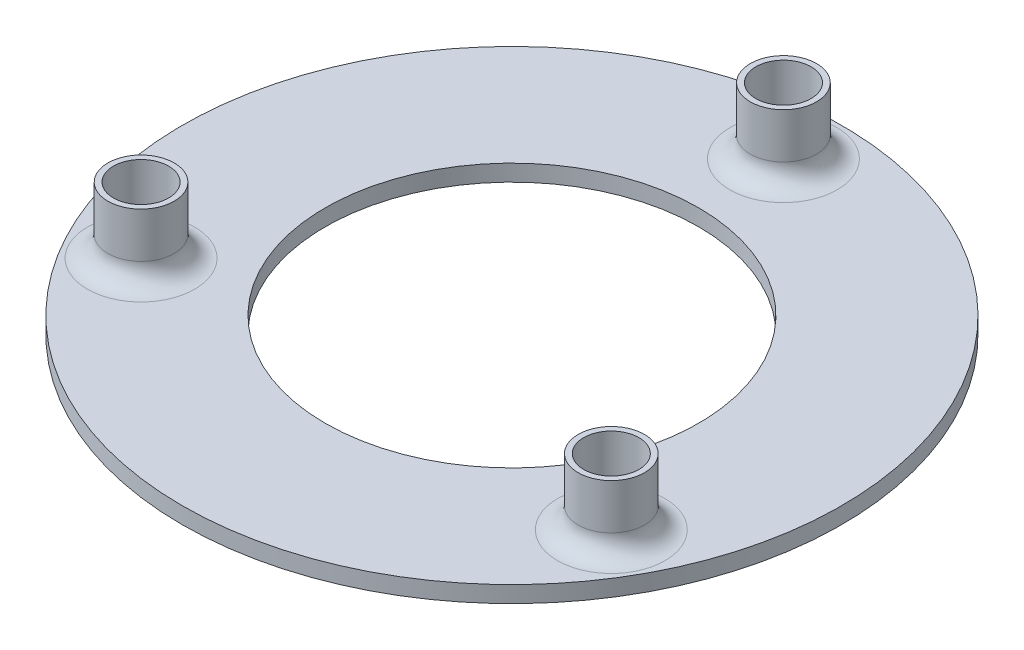
ISO-10303-21;
HEADER;
FILE_DESCRIPTION(('STEP AP214'),'2;1');
FILE_NAME('part.step','',(''),(''),'','','');
FILE_SCHEMA(('AUTOMOTIVE_DESIGN { 1 0 10303 214 1 1 1 1 }'));
ENDSEC;
DATA;
#1=APPLICATION_CONTEXT('core data for automotive mechanical design processes');
#2=APPLICATION_PROTOCOL_DEFINITION('international standard','automotive_design',2000,#1);
#3=PRODUCT_CONTEXT('',#1,'mechanical');
#4=PRODUCT('Part','Part','',(#3));
#5=PRODUCT_RELATED_PRODUCT_CATEGORY('part','',(#4));
#6=PRODUCT_DEFINITION_FORMATION('','',#4);
#7=PRODUCT_DEFINITION_CONTEXT('part definition',#1,'design');
#8=PRODUCT_DEFINITION('design','',#6,#7);
#9=PRODUCT_DEFINITION_SHAPE('','',#8);
#10=(LENGTH_UNIT() NAMED_UNIT(*) SI_UNIT(.MILLI.,.METRE.));
#11=(NAMED_UNIT(*) PLANE_ANGLE_UNIT() SI_UNIT($,.RADIAN.));
#12=(NAMED_UNIT(*) SI_UNIT($,.STERADIAN.) SOLID_ANGLE_UNIT());
#13=UNCERTAINTY_MEASURE_WITH_UNIT(LENGTH_MEASURE(1.E-05),#10,'distance_accuracy_value','');
#14=(GEOMETRIC_REPRESENTATION_CONTEXT(3) GLOBAL_UNCERTAINTY_ASSIGNED_CONTEXT((#13)) GLOBAL_UNIT_ASSIGNED_CONTEXT((#10,
#11,#12)) REPRESENTATION_CONTEXT('',''));
#15=CARTESIAN_POINT('',(0.,0.,0.));
#16=DIRECTION('',(0.,0.,1.));
#17=DIRECTION('',(1.,0.,0.));
#18=AXIS2_PLACEMENT_3D('',#15,#16,#17);
#19=CARTESIAN_POINT('',(0.,4.,0.));
#20=DIRECTION('',(0.,1.,0.));
#21=DIRECTION('',(0.,0.,1.));
#22=AXIS2_PLACEMENT_3D('',#19,#20,#21);
#23=PLANE('',#22);
#24=CARTESIAN_POINT('',(57.0778085372855,4.,32.954885136184));
#25=DIRECTION('',(0.,1.,0.));
#26=DIRECTION('',(0.,0.,1.));
#27=AXIS2_PLACEMENT_3D('',#24,#25,#26);
#28=CIRCLE('',#27,13.0460618645463);
#29=CARTESIAN_POINT('',(57.0778085372855,4.,46.0009470007304));
#30=VERTEX_POINT('',#29);
#31=EDGE_CURVE('E67',#30,#30,#28,.F.);
#32=ORIENTED_EDGE('',*,*,#31,.T.);
#33=EDGE_LOOP('',(#32));
#34=FACE_BOUND('',#33,.T.);
#35=CARTESIAN_POINT('',(0.0012626430097959,4.,-65.9045922732219));
#36=DIRECTION('',(0.,1.,0.));
#37=DIRECTION('',(0.,0.,1.));
#38=AXIS2_PLACEMENT_3D('',#35,#36,#37);
#39=CIRCLE('',#38,13.0460618645463);
#40=CARTESIAN_POINT('',(0.0012626430097959,4.,-52.8585304086756));
#41=VERTEX_POINT('',#40);
#42=EDGE_CURVE('E73',#41,#41,#39,.F.);
#43=ORIENTED_EDGE('',*,*,#42,.T.);
#44=EDGE_LOOP('',(#43));
#45=FACE_BOUND('',#44,.T.);
#46=CARTESIAN_POINT('',(-57.0752832512517,4.,32.9548851361923));
#47=DIRECTION('',(0.,1.,0.));
#48=DIRECTION('',(0.,0.,1.));
#49=AXIS2_PLACEMENT_3D('',#46,#47,#48);
#50=CIRCLE('',#49,13.0460618645463);
#51=CARTESIAN_POINT('',(-57.0752832512517,4.,46.0009470007387));
#52=VERTEX_POINT('',#51);
#53=EDGE_CURVE('E77',#52,#52,#50,.F.);
#54=ORIENTED_EDGE('',*,*,#53,.T.);
#55=EDGE_LOOP('',(#54));
#56=FACE_BOUND('',#55,.T.);
#57=CARTESIAN_POINT('',(0.,4.,0.));
#58=DIRECTION('',(0.,1.,0.));
#59=DIRECTION('',(0.,0.,1.));
#60=AXIS2_PLACEMENT_3D('',#57,#58,#59);
#61=CIRCLE('',#60,80.);
#62=CARTESIAN_POINT('',(0.,4.,80.));
#63=VERTEX_POINT('',#62);
#64=EDGE_CURVE('E86',#63,#63,#61,.T.);
#65=ORIENTED_EDGE('',*,*,#64,.T.);
#66=EDGE_LOOP('',(#65));
#67=FACE_BOUND('',#66,.T.);
#68=CARTESIAN_POINT('',(0.,4.,0.));
#69=DIRECTION('',(0.,1.,0.));
#70=DIRECTION('',(0.,0.,1.));
#71=AXIS2_PLACEMENT_3D('',#68,#69,#70);
#72=CIRCLE('',#71,45.315839153059);
#73=CARTESIAN_POINT('',(0.,4.,45.315839153059));
#74=VERTEX_POINT('',#73);
#75=EDGE_CURVE('E87',#74,#74,#72,.T.);
#76=ORIENTED_EDGE('',*,*,#75,.F.);
#77=EDGE_LOOP('',(#76));
#78=FACE_BOUND('',#77,.T.);
#79=ADVANCED_FACE('F49',(#34,#45,#56,#67,#78),#23,.T.);
#80=CARTESIAN_POINT('',(0.,0.,0.));
#81=DIRECTION('',(0.,1.,0.));
#82=DIRECTION('',(0.,0.,1.));
#83=AXIS2_PLACEMENT_3D('',#80,#81,#82);
#84=PLANE('',#83);
#85=CARTESIAN_POINT('',(0.,0.,0.));
#86=DIRECTION('',(0.,1.,0.));
#87=DIRECTION('',(0.,0.,1.));
#88=AXIS2_PLACEMENT_3D('',#85,#86,#87);
#89=CIRCLE('',#88,80.);
#90=CARTESIAN_POINT('',(0.,0.,80.));
#91=VERTEX_POINT('',#90);
#92=EDGE_CURVE('E82',#91,#91,#89,.T.);
#93=ORIENTED_EDGE('',*,*,#92,.F.);
#94=EDGE_LOOP('',(#93));
#95=FACE_BOUND('',#94,.T.);
#96=CARTESIAN_POINT('',(0.,0.,0.));
#97=DIRECTION('',(0.,1.,0.));
#98=DIRECTION('',(0.,0.,1.));
#99=AXIS2_PLACEMENT_3D('',#96,#97,#98);
#100=CIRCLE('',#99,45.315839153059);
#101=CARTESIAN_POINT('',(0.,0.,45.315839153059));
#102=VERTEX_POINT('',#101);
#103=EDGE_CURVE('E92',#102,#102,#100,.T.);
#104=ORIENTED_EDGE('',*,*,#103,.T.);
#105=EDGE_LOOP('',(#104));
#106=FACE_BOUND('',#105,.T.);
#107=ADVANCED_FACE('F154',(#95,#106),#84,.F.);
#108=CARTESIAN_POINT('',(0.,4.,0.));
#109=DIRECTION('',(0.,-1.,0.));
#110=DIRECTION('',(0.,0.,-1.));
#111=AXIS2_PLACEMENT_3D('',#108,#109,#110);
#112=CYLINDRICAL_SURFACE('',#111,80.);
#113=ORIENTED_EDGE('',*,*,#64,.F.);
#114=EDGE_LOOP('',(#113));
#115=FACE_BOUND('',#114,.T.);
#116=ORIENTED_EDGE('',*,*,#92,.T.);
#117=EDGE_LOOP('',(#116));
#118=FACE_BOUND('',#117,.T.);
#119=ADVANCED_FACE('F161',(#115,#118),#112,.T.);
#120=CARTESIAN_POINT('',(0.,4.,0.));
#121=DIRECTION('',(0.,-1.,0.));
#122=DIRECTION('',(0.,0.,-1.));
#123=AXIS2_PLACEMENT_3D('',#120,#121,#122);
#124=CYLINDRICAL_SURFACE('',#123,45.315839153059);
#125=ORIENTED_EDGE('',*,*,#75,.T.);
#126=EDGE_LOOP('',(#125));
#127=FACE_BOUND('',#126,.T.);
#128=ORIENTED_EDGE('',*,*,#103,.F.);
#129=EDGE_LOOP('',(#128));
#130=FACE_BOUND('',#129,.T.);
#131=ADVANCED_FACE('F207',(#127,#130),#124,.F.);
#132=CARTESIAN_POINT('',(-57.0752832512517,20.,32.9548851361923));
#133=DIRECTION('',(0.,-1.,0.));
#134=DIRECTION('',(0.,0.,-1.));
#135=AXIS2_PLACEMENT_3D('',#132,#133,#134);
#136=CYLINDRICAL_SURFACE('',#135,6.70505155378861);
#137=CARTESIAN_POINT('',(-57.0752832512517,4.,32.9548851361923));
#138=DIRECTION('',(0.,1.,0.));
#139=DIRECTION('',(0.,0.,1.));
#140=AXIS2_PLACEMENT_3D('',#137,#138,#139);
#141=CIRCLE('',#140,6.70505155378861);
#142=CARTESIAN_POINT('',(-57.0752832512517,4.,39.6599366899809));
#143=VERTEX_POINT('',#142);
#144=EDGE_CURVE('E91',#143,#143,#141,.F.);
#145=ORIENTED_EDGE('',*,*,#144,.T.);
#146=EDGE_LOOP('',(#145));
#147=FACE_BOUND('',#146,.T.);
#148=CARTESIAN_POINT('',(-57.0752832512517,20.,32.9548851361923));
#149=DIRECTION('',(0.,1.,0.));
#150=DIRECTION('',(0.,0.,1.));
#151=AXIS2_PLACEMENT_3D('',#148,#149,#150);
#152=CIRCLE('',#151,6.70505155378861);
#153=CARTESIAN_POINT('',(-57.0752832512517,20.,39.6599366899809));
#154=VERTEX_POINT('',#153);
#155=EDGE_CURVE('E107',#154,#154,#152,.T.);
#156=ORIENTED_EDGE('',*,*,#155,.T.);
#157=EDGE_LOOP('',(#156));
#158=FACE_BOUND('',#157,.T.);
#159=ADVANCED_FACE('F205',(#147,#158),#136,.F.);
#160=CARTESIAN_POINT('',(-57.0752832512517,20.,32.9548851361923));
#161=DIRECTION('',(0.,-1.,0.));
#162=DIRECTION('',(0.,0.,-1.));
#163=AXIS2_PLACEMENT_3D('',#160,#161,#162);
#164=CYLINDRICAL_SURFACE('',#163,8.04606186454634);
#165=CARTESIAN_POINT('',(-57.0752832512517,9.,32.9548851361923));
#166=DIRECTION('',(0.,1.,0.));
#167=DIRECTION('',(0.,0.,1.));
#168=AXIS2_PLACEMENT_3D('',#165,#166,#167);
#169=CIRCLE('',#168,8.04606186454634);
#170=CARTESIAN_POINT('',(-57.0752832512517,9.,41.0009470007387));
#171=VERTEX_POINT('',#170);
#172=EDGE_CURVE('E11',#171,#171,#169,.T.);
#173=ORIENTED_EDGE('',*,*,#172,.T.);
#174=EDGE_LOOP('',(#173));
#175=FACE_BOUND('',#174,.T.);
#176=CARTESIAN_POINT('',(-57.0752832512517,20.,32.9548851361923));
#177=DIRECTION('',(0.,1.,0.));
#178=DIRECTION('',(0.,0.,1.));
#179=AXIS2_PLACEMENT_3D('',#176,#177,#178);
#180=CIRCLE('',#179,8.04606186454634);
#181=CARTESIAN_POINT('',(-57.0752832512517,20.,41.0009470007387));
#182=VERTEX_POINT('',#181);
#183=EDGE_CURVE('E96',#182,#182,#180,.T.);
#184=ORIENTED_EDGE('',*,*,#183,.F.);
#185=EDGE_LOOP('',(#184));
#186=FACE_BOUND('',#185,.T.);
#187=ADVANCED_FACE('F180',(#175,#186),#164,.T.);
#188=CARTESIAN_POINT('',(0.,20.,0.));
#189=DIRECTION('',(0.,1.,0.));
#190=DIRECTION('',(0.,0.,1.));
#191=AXIS2_PLACEMENT_3D('',#188,#189,#190);
#192=PLANE('',#191);
#193=ORIENTED_EDGE('',*,*,#155,.F.);
#194=EDGE_LOOP('',(#193));
#195=FACE_BOUND('',#194,.T.);
#196=ORIENTED_EDGE('',*,*,#183,.T.);
#197=EDGE_LOOP('',(#196));
#198=FACE_BOUND('',#197,.T.);
#199=ADVANCED_FACE('F171',(#195,#198),#192,.T.);
#200=ORIENTED_EDGE('',*,*,#144,.F.);
#201=EDGE_LOOP('',(#200));
#202=FACE_BOUND('',#201,.T.);
#203=ADVANCED_FACE('F157',(#202),#23,.T.);
#204=CARTESIAN_POINT('',(0.0012626430097959,20.,-65.9045922732219));
#205=DIRECTION('',(0.,-1.,0.));
#206=DIRECTION('',(0.,0.,-1.));
#207=AXIS2_PLACEMENT_3D('',#204,#205,#206);
#208=CYLINDRICAL_SURFACE('',#207,6.7050515537886);
#209=CARTESIAN_POINT('',(0.0012626430097959,4.,-65.9045922732219));
#210=DIRECTION('',(0.,1.,0.));
#211=DIRECTION('',(0.,0.,1.));
#212=AXIS2_PLACEMENT_3D('',#209,#210,#211);
#213=CIRCLE('',#212,6.7050515537886);
#214=CARTESIAN_POINT('',(0.0012626430097959,4.,-59.1995407194333));
#215=VERTEX_POINT('',#214);
#216=EDGE_CURVE('E103',#215,#215,#213,.F.);
#217=ORIENTED_EDGE('',*,*,#216,.T.);
#218=EDGE_LOOP('',(#217));
#219=FACE_BOUND('',#218,.T.);
#220=CARTESIAN_POINT('',(0.0012626430097959,20.,-65.9045922732219));
#221=DIRECTION('',(0.,1.,0.));
#222=DIRECTION('',(0.,0.,1.));
#223=AXIS2_PLACEMENT_3D('',#220,#221,#222);
#224=CIRCLE('',#223,6.7050515537886);
#225=CARTESIAN_POINT('',(0.0012626430097959,20.,-59.1995407194333));
#226=VERTEX_POINT('',#225);
#227=EDGE_CURVE('E118',#226,#226,#224,.T.);
#228=ORIENTED_EDGE('',*,*,#227,.T.);
#229=EDGE_LOOP('',(#228));
#230=FACE_BOUND('',#229,.T.);
#231=ADVANCED_FACE('F170',(#219,#230),#208,.F.);
#232=CARTESIAN_POINT('',(0.0012626430097959,20.,-65.9045922732219));
#233=DIRECTION('',(0.,-1.,0.));
#234=DIRECTION('',(0.,0.,-1.));
#235=AXIS2_PLACEMENT_3D('',#232,#233,#234);
#236=CYLINDRICAL_SURFACE('',#235,8.04606186454632);
#237=CARTESIAN_POINT('',(0.0012626430097959,9.,-65.9045922732219));
#238=DIRECTION('',(0.,1.,0.));
#239=DIRECTION('',(0.,0.,1.));
#240=AXIS2_PLACEMENT_3D('',#237,#238,#239);
#241=CIRCLE('',#240,8.04606186454632);
#242=CARTESIAN_POINT('',(0.0012626430097959,9.,-57.8585304086756));
#243=VERTEX_POINT('',#242);
#244=EDGE_CURVE('E57',#243,#243,#241,.T.);
#245=ORIENTED_EDGE('',*,*,#244,.T.);
#246=EDGE_LOOP('',(#245));
#247=FACE_BOUND('',#246,.T.);
#248=CARTESIAN_POINT('',(0.0012626430097959,20.,-65.9045922732219));
#249=DIRECTION('',(0.,1.,0.));
#250=DIRECTION('',(0.,0.,1.));
#251=AXIS2_PLACEMENT_3D('',#248,#249,#250);
#252=CIRCLE('',#251,8.04606186454632);
#253=CARTESIAN_POINT('',(0.0012626430097959,20.,-57.8585304086756));
#254=VERTEX_POINT('',#253);
#255=EDGE_CURVE('E111',#254,#254,#252,.T.);
#256=ORIENTED_EDGE('',*,*,#255,.F.);
#257=EDGE_LOOP('',(#256));
#258=FACE_BOUND('',#257,.T.);
#259=ADVANCED_FACE('F177',(#247,#258),#236,.T.);
#260=CARTESIAN_POINT('',(0.,20.,0.));
#261=DIRECTION('',(0.,1.,0.));
#262=DIRECTION('',(0.,0.,1.));
#263=AXIS2_PLACEMENT_3D('',#260,#261,#262);
#264=PLANE('',#263);
#265=ORIENTED_EDGE('',*,*,#227,.F.);
#266=EDGE_LOOP('',(#265));
#267=FACE_BOUND('',#266,.T.);
#268=ORIENTED_EDGE('',*,*,#255,.T.);
#269=EDGE_LOOP('',(#268));
#270=FACE_BOUND('',#269,.T.);
#271=ADVANCED_FACE('F185',(#267,#270),#264,.T.);
#272=ORIENTED_EDGE('',*,*,#216,.F.);
#273=EDGE_LOOP('',(#272));
#274=FACE_BOUND('',#273,.T.);
#275=ADVANCED_FACE('F150',(#274),#23,.T.);
#276=CARTESIAN_POINT('',(57.0778085372855,20.,32.954885136184));
#277=DIRECTION('',(0.,-1.,0.));
#278=DIRECTION('',(0.,0.,-1.));
#279=AXIS2_PLACEMENT_3D('',#276,#277,#278);
#280=CYLINDRICAL_SURFACE('',#279,6.70505155378861);
#281=CARTESIAN_POINT('',(57.0778085372855,4.,32.954885136184));
#282=DIRECTION('',(0.,1.,0.));
#283=DIRECTION('',(0.,0.,1.));
#284=AXIS2_PLACEMENT_3D('',#281,#282,#283);
#285=CIRCLE('',#284,6.70505155378861);
#286=CARTESIAN_POINT('',(57.0778085372855,4.,39.6599366899726));
#287=VERTEX_POINT('',#286);
#288=EDGE_CURVE('E81',#287,#287,#285,.F.);
#289=ORIENTED_EDGE('',*,*,#288,.T.);
#290=EDGE_LOOP('',(#289));
#291=FACE_BOUND('',#290,.T.);
#292=CARTESIAN_POINT('',(57.0778085372855,20.,32.954885136184));
#293=DIRECTION('',(0.,1.,0.));
#294=DIRECTION('',(0.,0.,1.));
#295=AXIS2_PLACEMENT_3D('',#292,#293,#294);
#296=CIRCLE('',#295,6.70505155378861);
#297=CARTESIAN_POINT('',(57.0778085372855,20.,39.6599366899726));
#298=VERTEX_POINT('',#297);
#299=EDGE_CURVE('E129',#298,#298,#296,.T.);
#300=ORIENTED_EDGE('',*,*,#299,.T.);
#301=EDGE_LOOP('',(#300));
#302=FACE_BOUND('',#301,.T.);
#303=ADVANCED_FACE('F134',(#291,#302),#280,.F.);
#304=CARTESIAN_POINT('',(57.0778085372855,20.,32.954885136184));
#305=DIRECTION('',(0.,-1.,0.));
#306=DIRECTION('',(0.,0.,-1.));
#307=AXIS2_PLACEMENT_3D('',#304,#305,#306);
#308=CYLINDRICAL_SURFACE('',#307,8.04606186454634);
#309=CARTESIAN_POINT('',(57.0778085372855,9.,32.954885136184));
#310=DIRECTION('',(0.,1.,0.));
#311=DIRECTION('',(0.,0.,1.));
#312=AXIS2_PLACEMENT_3D('',#309,#310,#311);
#313=CIRCLE('',#312,8.04606186454634);
#314=CARTESIAN_POINT('',(57.0778085372855,9.,41.0009470007304));
#315=VERTEX_POINT('',#314);
#316=EDGE_CURVE('E62',#315,#315,#313,.T.);
#317=ORIENTED_EDGE('',*,*,#316,.T.);
#318=EDGE_LOOP('',(#317));
#319=FACE_BOUND('',#318,.T.);
#320=CARTESIAN_POINT('',(57.0778085372855,20.,32.954885136184));
#321=DIRECTION('',(0.,1.,0.));
#322=DIRECTION('',(0.,0.,1.));
#323=AXIS2_PLACEMENT_3D('',#320,#321,#322);
#324=CIRCLE('',#323,8.04606186454634);
#325=CARTESIAN_POINT('',(57.0778085372855,20.,41.0009470007304));
#326=VERTEX_POINT('',#325);
#327=EDGE_CURVE('E122',#326,#326,#324,.T.);
#328=ORIENTED_EDGE('',*,*,#327,.F.);
#329=EDGE_LOOP('',(#328));
#330=FACE_BOUND('',#329,.T.);
#331=ADVANCED_FACE('F140',(#319,#330),#308,.T.);
#332=CARTESIAN_POINT('',(0.,20.,0.));
#333=DIRECTION('',(0.,1.,0.));
#334=DIRECTION('',(0.,0.,1.));
#335=AXIS2_PLACEMENT_3D('',#332,#333,#334);
#336=PLANE('',#335);
#337=ORIENTED_EDGE('',*,*,#299,.F.);
#338=EDGE_LOOP('',(#337));
#339=FACE_BOUND('',#338,.T.);
#340=ORIENTED_EDGE('',*,*,#327,.T.);
#341=EDGE_LOOP('',(#340));
#342=FACE_BOUND('',#341,.T.);
#343=ADVANCED_FACE('F136',(#339,#342),#336,.T.);
#344=ORIENTED_EDGE('',*,*,#288,.F.);
#345=EDGE_LOOP('',(#344));
#346=FACE_BOUND('',#345,.T.);
#347=ADVANCED_FACE('F139',(#346),#23,.T.);
#348=CARTESIAN_POINT('',(57.0778085372855,9.,32.954885136184));
#349=DIRECTION('',(0.,1.,0.));
#350=DIRECTION('',(0.,0.,1.));
#351=AXIS2_PLACEMENT_3D('',#348,#349,#350);
#352=TOROIDAL_SURFACE('',#351,13.0460618645463,5.);
#353=ORIENTED_EDGE('',*,*,#316,.F.);
#354=EDGE_LOOP('',(#353));
#355=FACE_BOUND('',#354,.T.);
#356=ORIENTED_EDGE('',*,*,#31,.F.);
#357=EDGE_LOOP('',(#356));
#358=FACE_BOUND('',#357,.T.);
#359=ADVANCED_FACE('F167',(#355,#358),#352,.F.);
#360=CARTESIAN_POINT('',(0.0012626430097959,9.,-65.9045922732219));
#361=DIRECTION('',(0.,1.,0.));
#362=DIRECTION('',(0.,0.,1.));
#363=AXIS2_PLACEMENT_3D('',#360,#361,#362);
#364=TOROIDAL_SURFACE('',#363,13.0460618645463,5.);
#365=ORIENTED_EDGE('',*,*,#244,.F.);
#366=EDGE_LOOP('',(#365));
#367=FACE_BOUND('',#366,.T.);
#368=ORIENTED_EDGE('',*,*,#42,.F.);
#369=EDGE_LOOP('',(#368));
#370=FACE_BOUND('',#369,.T.);
#371=ADVANCED_FACE('F227',(#367,#370),#364,.F.);
#372=CARTESIAN_POINT('',(-57.0752832512517,9.,32.9548851361923));
#373=DIRECTION('',(0.,1.,0.));
#374=DIRECTION('',(0.,0.,1.));
#375=AXIS2_PLACEMENT_3D('',#372,#373,#374);
#376=TOROIDAL_SURFACE('',#375,13.0460618645463,5.);
#377=ORIENTED_EDGE('',*,*,#172,.F.);
#378=EDGE_LOOP('',(#377));
#379=FACE_BOUND('',#378,.T.);
#380=ORIENTED_EDGE('',*,*,#53,.F.);
#381=EDGE_LOOP('',(#380));
#382=FACE_BOUND('',#381,.T.);
#383=ADVANCED_FACE('F51',(#379,#382),#376,.F.);
#384=CLOSED_SHELL('',(#79,#107,#119,#131,#159,#187,#199,#203,#231,#259,#271,#275,#303,#331,#343,
#347,#359,#371,#383));
#385=MANIFOLD_SOLID_BREP('B2',#384);
#386=ADVANCED_BREP_SHAPE_REPRESENTATION('',(#18,#385),#14);
#387=SHAPE_DEFINITION_REPRESENTATION(#9,#386);
ENDSEC;
END-ISO-10303-21;
